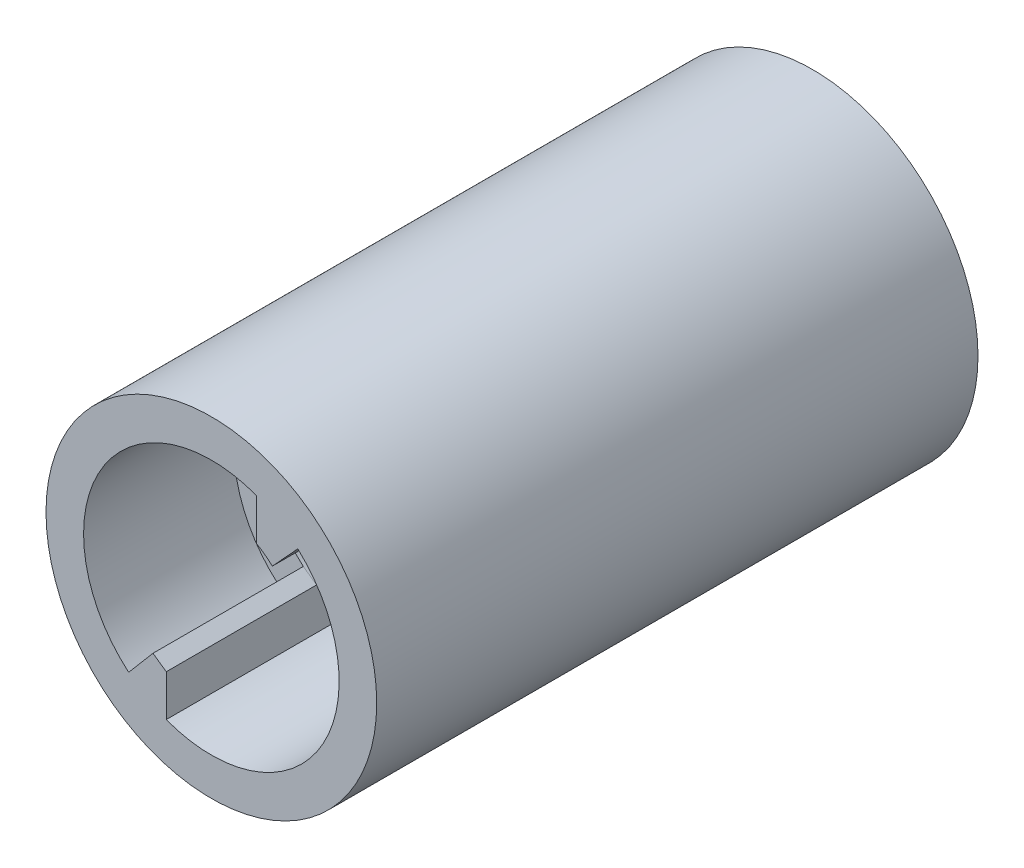
ISO-10303-21;
HEADER;
FILE_DESCRIPTION(('STEP AP214'),'2;1');
FILE_NAME('part.step','',(''),(''),'','','');
FILE_SCHEMA(('AUTOMOTIVE_DESIGN { 1 0 10303 214 1 1 1 1 }'));
ENDSEC;
DATA;
#1=APPLICATION_CONTEXT('core data for automotive mechanical design processes');
#2=APPLICATION_PROTOCOL_DEFINITION('international standard','automotive_design',2000,#1);
#3=PRODUCT_CONTEXT('',#1,'mechanical');
#4=PRODUCT('Part','Part','',(#3));
#5=PRODUCT_RELATED_PRODUCT_CATEGORY('part','',(#4));
#6=PRODUCT_DEFINITION_FORMATION('','',#4);
#7=PRODUCT_DEFINITION_CONTEXT('part definition',#1,'design');
#8=PRODUCT_DEFINITION('design','',#6,#7);
#9=PRODUCT_DEFINITION_SHAPE('','',#8);
#10=(LENGTH_UNIT() NAMED_UNIT(*) SI_UNIT(.MILLI.,.METRE.));
#11=(NAMED_UNIT(*) PLANE_ANGLE_UNIT() SI_UNIT($,.RADIAN.));
#12=(NAMED_UNIT(*) SI_UNIT($,.STERADIAN.) SOLID_ANGLE_UNIT());
#13=UNCERTAINTY_MEASURE_WITH_UNIT(LENGTH_MEASURE(1.E-05),#10,'distance_accuracy_value','');
#14=(GEOMETRIC_REPRESENTATION_CONTEXT(3) GLOBAL_UNCERTAINTY_ASSIGNED_CONTEXT((#13)) GLOBAL_UNIT_ASSIGNED_CONTEXT((#10,
#11,#12)) REPRESENTATION_CONTEXT('',''));
#15=CARTESIAN_POINT('',(0.,0.,0.));
#16=DIRECTION('',(0.,0.,1.));
#17=DIRECTION('',(1.,0.,0.));
#18=AXIS2_PLACEMENT_3D('',#15,#16,#17);
#19=CARTESIAN_POINT('',(3.,11.,0.));
#20=DIRECTION('',(1.,0.,0.));
#21=DIRECTION('',(0.,1.,0.));
#22=AXIS2_PLACEMENT_3D('',#19,#20,#21);
#23=PLANE('',#22);
#24=DIRECTION('',(0.,0.,-1.));
#25=VECTOR('',#24,1.);
#26=CARTESIAN_POINT('',(3.,7.95298686029343,25.));
#27=LINE('',#26,#25);
#28=CARTESIAN_POINT('',(3.,7.95298686029343,35.));
#29=VERTEX_POINT('',#28);
#30=CARTESIAN_POINT('',(3.,7.95298686029343,-5.));
#31=VERTEX_POINT('',#30);
#32=EDGE_CURVE('E55',#29,#31,#27,.T.);
#33=ORIENTED_EDGE('',*,*,#32,.T.);
#34=DIRECTION('',(0.,-1.,0.));
#35=VECTOR('',#34,1.);
#36=CARTESIAN_POINT('',(3.,0.,-5.));
#37=LINE('',#36,#35);
#38=CARTESIAN_POINT('',(3.,5.19615242270663,-5.));
#39=VERTEX_POINT('',#38);
#40=EDGE_CURVE('E11',#31,#39,#37,.T.);
#41=ORIENTED_EDGE('',*,*,#40,.T.);
#42=DIRECTION('',(0.,0.,-1.));
#43=VECTOR('',#42,1.);
#44=CARTESIAN_POINT('',(3.,5.19615242270663,25.));
#45=LINE('',#44,#43);
#46=CARTESIAN_POINT('',(3.,5.19615242270663,35.));
#47=VERTEX_POINT('',#46);
#48=EDGE_CURVE('E229',#39,#47,#45,.F.);
#49=ORIENTED_EDGE('',*,*,#48,.T.);
#50=DIRECTION('',(0.,-1.,0.));
#51=VECTOR('',#50,1.);
#52=CARTESIAN_POINT('',(3.,5.19615242270663,35.));
#53=LINE('',#52,#51);
#54=EDGE_CURVE('E213',#29,#47,#53,.T.);
#55=ORIENTED_EDGE('',*,*,#54,.F.);
#56=EDGE_LOOP('',(#33,#41,#49,#55));
#57=FACE_BOUND('',#56,.T.);
#58=ADVANCED_FACE('F41',(#57),#23,.F.);
#59=CARTESIAN_POINT('',(3.,-5.19615242270663,-5.));
#60=VERTEX_POINT('',#59);
#61=CARTESIAN_POINT('',(3.,-7.95298686029343,-5.));
#62=VERTEX_POINT('',#61);
#63=EDGE_CURVE('E45',#60,#62,#37,.T.);
#64=ORIENTED_EDGE('',*,*,#63,.T.);
#65=DIRECTION('',(0.,0.,-1.));
#66=VECTOR('',#65,1.);
#67=CARTESIAN_POINT('',(3.,-7.95298686029343,25.));
#68=LINE('',#67,#66);
#69=CARTESIAN_POINT('',(3.,-7.95298686029343,25.));
#70=VERTEX_POINT('',#69);
#71=EDGE_CURVE('E63',#62,#70,#68,.F.);
#72=ORIENTED_EDGE('',*,*,#71,.T.);
#73=DIRECTION('',(0.,1.,0.));
#74=VECTOR('',#73,1.);
#75=CARTESIAN_POINT('',(3.,11.,25.));
#76=LINE('',#75,#74);
#77=CARTESIAN_POINT('',(3.,-5.19615242270663,25.));
#78=VERTEX_POINT('',#77);
#79=EDGE_CURVE('E228',#70,#78,#76,.T.);
#80=ORIENTED_EDGE('',*,*,#79,.T.);
#81=DIRECTION('',(0.,0.,-1.));
#82=VECTOR('',#81,1.);
#83=CARTESIAN_POINT('',(3.,-5.19615242270663,25.));
#84=LINE('',#83,#82);
#85=EDGE_CURVE('E226',#78,#60,#84,.T.);
#86=ORIENTED_EDGE('',*,*,#85,.T.);
#87=EDGE_LOOP('',(#64,#72,#80,#86));
#88=FACE_BOUND('',#87,.T.);
#89=ADVANCED_FACE('F270',(#88),#23,.F.);
#90=CARTESIAN_POINT('',(-3.,11.,0.));
#91=DIRECTION('',(-1.,0.,0.));
#92=DIRECTION('',(0.,-1.,0.));
#93=AXIS2_PLACEMENT_3D('',#90,#91,#92);
#94=PLANE('',#93);
#95=DIRECTION('',(0.,0.,-1.));
#96=VECTOR('',#95,1.);
#97=CARTESIAN_POINT('',(-3.,-7.95298686029343,25.));
#98=LINE('',#97,#96);
#99=CARTESIAN_POINT('',(-3.,-7.95298686029343,-5.));
#100=VERTEX_POINT('',#99);
#101=CARTESIAN_POINT('',(-3.,-7.95298686029343,35.));
#102=VERTEX_POINT('',#101);
#103=EDGE_CURVE('E139',#100,#102,#98,.F.);
#104=ORIENTED_EDGE('',*,*,#103,.F.);
#105=DIRECTION('',(0.,1.,0.));
#106=VECTOR('',#105,1.);
#107=CARTESIAN_POINT('',(-3.,0.,-5.));
#108=LINE('',#107,#106);
#109=CARTESIAN_POINT('',(-3.,-5.19615242270663,-5.));
#110=VERTEX_POINT('',#109);
#111=EDGE_CURVE('E133',#100,#110,#108,.T.);
#112=ORIENTED_EDGE('',*,*,#111,.T.);
#113=DIRECTION('',(0.,0.,-1.));
#114=VECTOR('',#113,1.);
#115=CARTESIAN_POINT('',(-3.,-5.19615242270663,25.));
#116=LINE('',#115,#114);
#117=CARTESIAN_POINT('',(-3.,-5.19615242270663,25.));
#118=VERTEX_POINT('',#117);
#119=EDGE_CURVE('E137',#110,#118,#116,.F.);
#120=ORIENTED_EDGE('',*,*,#119,.T.);
#121=DIRECTION('',(0.,0.,-1.));
#122=VECTOR('',#121,1.);
#123=CARTESIAN_POINT('',(-3.,-5.19615242270663,35.));
#124=LINE('',#123,#122);
#125=CARTESIAN_POINT('',(-3.,-5.19615242270663,35.));
#126=VERTEX_POINT('',#125);
#127=EDGE_CURVE('E200',#126,#118,#124,.T.);
#128=ORIENTED_EDGE('',*,*,#127,.F.);
#129=DIRECTION('',(0.,1.,0.));
#130=VECTOR('',#129,1.);
#131=CARTESIAN_POINT('',(-3.,-10.5830052442584,35.));
#132=LINE('',#131,#130);
#133=EDGE_CURVE('E185',#102,#126,#132,.T.);
#134=ORIENTED_EDGE('',*,*,#133,.F.);
#135=EDGE_LOOP('',(#104,#112,#120,#128,#134));
#136=FACE_BOUND('',#135,.T.);
#137=ADVANCED_FACE('F135',(#136),#94,.F.);
#138=CARTESIAN_POINT('',(-3.,5.19615242270663,-5.));
#139=VERTEX_POINT('',#138);
#140=CARTESIAN_POINT('',(-3.,7.95298686029343,-5.));
#141=VERTEX_POINT('',#140);
#142=EDGE_CURVE('E143',#139,#141,#108,.T.);
#143=ORIENTED_EDGE('',*,*,#142,.T.);
#144=DIRECTION('',(0.,0.,-1.));
#145=VECTOR('',#144,1.);
#146=CARTESIAN_POINT('',(-3.,7.95298686029343,25.));
#147=LINE('',#146,#145);
#148=CARTESIAN_POINT('',(-3.,7.95298686029343,25.));
#149=VERTEX_POINT('',#148);
#150=EDGE_CURVE('E236',#149,#141,#147,.T.);
#151=ORIENTED_EDGE('',*,*,#150,.F.);
#152=DIRECTION('',(0.,-1.,0.));
#153=VECTOR('',#152,1.);
#154=CARTESIAN_POINT('',(-3.,11.,25.));
#155=LINE('',#154,#153);
#156=CARTESIAN_POINT('',(-3.,5.19615242270663,25.));
#157=VERTEX_POINT('',#156);
#158=EDGE_CURVE('E220',#149,#157,#155,.T.);
#159=ORIENTED_EDGE('',*,*,#158,.T.);
#160=DIRECTION('',(0.,0.,-1.));
#161=VECTOR('',#160,1.);
#162=CARTESIAN_POINT('',(-3.,5.19615242270663,25.));
#163=LINE('',#162,#161);
#164=EDGE_CURVE('E152',#157,#139,#163,.T.);
#165=ORIENTED_EDGE('',*,*,#164,.T.);
#166=EDGE_LOOP('',(#143,#151,#159,#165));
#167=FACE_BOUND('',#166,.T.);
#168=ADVANCED_FACE('F240',(#167),#94,.F.);
#169=CARTESIAN_POINT('',(0.,0.,25.));
#170=DIRECTION('',(0.,0.,-1.));
#171=DIRECTION('',(-1.,0.,0.));
#172=AXIS2_PLACEMENT_3D('',#169,#170,#171);
#173=CYLINDRICAL_SURFACE('',#172,6.);
#174=CARTESIAN_POINT('',(0.,0.,-5.));
#175=DIRECTION('',(0.,0.,-1.));
#176=DIRECTION('',(-1.,0.,0.));
#177=AXIS2_PLACEMENT_3D('',#174,#175,#176);
#178=CIRCLE('',#177,6.);
#179=EDGE_CURVE('E160',#39,#60,#178,.T.);
#180=ORIENTED_EDGE('',*,*,#179,.T.);
#181=ORIENTED_EDGE('',*,*,#85,.F.);
#182=CARTESIAN_POINT('',(0.,0.,25.));
#183=DIRECTION('',(0.,0.,1.));
#184=DIRECTION('',(1.,0.,0.));
#185=AXIS2_PLACEMENT_3D('',#182,#183,#184);
#186=CIRCLE('',#185,6.);
#187=CARTESIAN_POINT('',(4.05923501808678,4.41843989072365,25.));
#188=VERTEX_POINT('',#187);
#189=EDGE_CURVE('E225',#78,#188,#186,.T.);
#190=ORIENTED_EDGE('',*,*,#189,.T.);
#191=DIRECTION('',(0.,0.,-1.));
#192=VECTOR('',#191,1.);
#193=CARTESIAN_POINT('',(4.05923501808678,4.41843989072365,35.));
#194=LINE('',#193,#192);
#195=CARTESIAN_POINT('',(4.05923501808678,4.41843989072365,35.));
#196=VERTEX_POINT('',#195);
#197=EDGE_CURVE('E215',#196,#188,#194,.T.);
#198=ORIENTED_EDGE('',*,*,#197,.F.);
#199=CARTESIAN_POINT('',(-2.46608289344863E-11,-3.3586848580125E-11,35.));
#200=DIRECTION('',(0.,0.,-1.));
#201=DIRECTION('',(-1.,0.,0.));
#202=AXIS2_PLACEMENT_3D('',#199,#200,#201);
#203=CIRCLE('',#202,6.00000000004142);
#204=EDGE_CURVE('E204',#47,#196,#203,.T.);
#205=ORIENTED_EDGE('',*,*,#204,.F.);
#206=ORIENTED_EDGE('',*,*,#48,.F.);
#207=EDGE_LOOP('',(#180,#181,#190,#198,#205,#206));
#208=FACE_BOUND('',#207,.T.);
#209=ADVANCED_FACE('F283',(#208),#173,.F.);
#210=CARTESIAN_POINT('',(0.,0.,25.));
#211=DIRECTION('',(0.,0.,1.));
#212=DIRECTION('',(1.,0.,0.));
#213=AXIS2_PLACEMENT_3D('',#210,#211,#212);
#214=PLANE('',#213);
#215=CARTESIAN_POINT('',(0.,0.,25.));
#216=DIRECTION('',(0.,0.,1.));
#217=DIRECTION('',(1.,0.,0.));
#218=AXIS2_PLACEMENT_3D('',#215,#216,#217);
#219=CIRCLE('',#218,8.5);
#220=CARTESIAN_POINT('',(5.7505829422896,6.25945651185851,25.));
#221=VERTEX_POINT('',#220);
#222=EDGE_CURVE('E171',#70,#221,#219,.T.);
#223=ORIENTED_EDGE('',*,*,#222,.T.);
#224=DIRECTION('',(0.67653916968113,0.736406648453942,0.));
#225=VECTOR('',#224,1.);
#226=CARTESIAN_POINT('',(4.05923501808678,4.41843989072365,25.));
#227=LINE('',#226,#225);
#228=EDGE_CURVE('E203',#188,#221,#227,.T.);
#229=ORIENTED_EDGE('',*,*,#228,.F.);
#230=ORIENTED_EDGE('',*,*,#189,.F.);
#231=ORIENTED_EDGE('',*,*,#79,.F.);
#232=EDGE_LOOP('',(#223,#229,#230,#231));
#233=FACE_BOUND('',#232,.T.);
#234=ADVANCED_FACE('F43',(#233),#214,.T.);
#235=CARTESIAN_POINT('',(-5.50135305893383,-6.47959215699255,25.));
#236=VERTEX_POINT('',#235);
#237=EDGE_CURVE('E175',#149,#236,#219,.T.);
#238=ORIENTED_EDGE('',*,*,#237,.T.);
#239=DIRECTION('',(-0.647218006933392,-0.762304959646182,0.));
#240=VECTOR('',#239,1.);
#241=CARTESIAN_POINT('',(-7.11939807626731,-8.38535455610801,25.));
#242=LINE('',#241,#240);
#243=CARTESIAN_POINT('',(-3.88330804160035,-4.5738297578771,25.));
#244=VERTEX_POINT('',#243);
#245=EDGE_CURVE('E188',#244,#236,#242,.T.);
#246=ORIENTED_EDGE('',*,*,#245,.F.);
#247=CARTESIAN_POINT('',(0.,0.,25.));
#248=DIRECTION('',(0.,0.,1.));
#249=DIRECTION('',(1.,0.,0.));
#250=AXIS2_PLACEMENT_3D('',#247,#248,#249);
#251=CIRCLE('',#250,6.);
#252=EDGE_CURVE('E153',#157,#244,#251,.T.);
#253=ORIENTED_EDGE('',*,*,#252,.F.);
#254=ORIENTED_EDGE('',*,*,#158,.F.);
#255=EDGE_LOOP('',(#238,#246,#253,#254));
#256=FACE_BOUND('',#255,.T.);
#257=ADVANCED_FACE('F249',(#256),#214,.T.);
#258=CARTESIAN_POINT('',(0.,0.,25.));
#259=DIRECTION('',(0.,0.,-1.));
#260=DIRECTION('',(-1.,0.,0.));
#261=AXIS2_PLACEMENT_3D('',#258,#259,#260);
#262=CYLINDRICAL_SURFACE('',#261,8.5);
#263=ORIENTED_EDGE('',*,*,#71,.F.);
#264=CARTESIAN_POINT('',(0.,0.,-5.));
#265=DIRECTION('',(0.,0.,-1.));
#266=DIRECTION('',(-1.,0.,0.));
#267=AXIS2_PLACEMENT_3D('',#264,#265,#266);
#268=CIRCLE('',#267,8.5);
#269=EDGE_CURVE('E166',#62,#100,#268,.T.);
#270=ORIENTED_EDGE('',*,*,#269,.T.);
#271=ORIENTED_EDGE('',*,*,#103,.T.);
#272=CARTESIAN_POINT('',(0.,0.,35.));
#273=DIRECTION('',(0.,0.,1.));
#274=DIRECTION('',(1.,0.,0.));
#275=AXIS2_PLACEMENT_3D('',#272,#273,#274);
#276=CIRCLE('',#275,8.5);
#277=CARTESIAN_POINT('',(5.7505829422896,6.25945651185851,35.));
#278=VERTEX_POINT('',#277);
#279=EDGE_CURVE('E172',#102,#278,#276,.T.);
#280=ORIENTED_EDGE('',*,*,#279,.T.);
#281=DIRECTION('',(0.,0.,-1.));
#282=VECTOR('',#281,1.);
#283=CARTESIAN_POINT('',(5.7505829422896,6.25945651185851,35.));
#284=LINE('',#283,#282);
#285=EDGE_CURVE('E181',#221,#278,#284,.F.);
#286=ORIENTED_EDGE('',*,*,#285,.F.);
#287=ORIENTED_EDGE('',*,*,#222,.F.);
#288=EDGE_LOOP('',(#263,#270,#271,#280,#286,#287));
#289=FACE_BOUND('',#288,.T.);
#290=ADVANCED_FACE('F278',(#289),#262,.F.);
#291=ORIENTED_EDGE('',*,*,#32,.F.);
#292=CARTESIAN_POINT('',(-5.50135305893383,-6.47959215699255,35.));
#293=VERTEX_POINT('',#292);
#294=EDGE_CURVE('E174',#29,#293,#276,.T.);
#295=ORIENTED_EDGE('',*,*,#294,.T.);
#296=DIRECTION('',(0.,0.,-1.));
#297=VECTOR('',#296,1.);
#298=CARTESIAN_POINT('',(-5.50135305893383,-6.47959215699255,35.));
#299=LINE('',#298,#297);
#300=EDGE_CURVE('E178',#236,#293,#299,.F.);
#301=ORIENTED_EDGE('',*,*,#300,.F.);
#302=ORIENTED_EDGE('',*,*,#237,.F.);
#303=ORIENTED_EDGE('',*,*,#150,.T.);
#304=EDGE_CURVE('E161',#141,#31,#268,.T.);
#305=ORIENTED_EDGE('',*,*,#304,.T.);
#306=EDGE_LOOP('',(#291,#295,#301,#302,#303,#305));
#307=FACE_BOUND('',#306,.T.);
#308=ADVANCED_FACE('F244',(#307),#262,.F.);
#309=CARTESIAN_POINT('',(0.,0.,25.));
#310=DIRECTION('',(0.,0.,-1.));
#311=DIRECTION('',(-1.,0.,0.));
#312=AXIS2_PLACEMENT_3D('',#309,#310,#311);
#313=CYLINDRICAL_SURFACE('',#312,11.);
#314=CARTESIAN_POINT('',(0.,0.,-5.));
#315=DIRECTION('',(0.,0.,-1.));
#316=DIRECTION('',(-1.,0.,0.));
#317=AXIS2_PLACEMENT_3D('',#314,#315,#316);
#318=CIRCLE('',#317,11.);
#319=CARTESIAN_POINT('',(-11.,0.,-5.));
#320=VERTEX_POINT('',#319);
#321=EDGE_CURVE('E164',#320,#320,#318,.T.);
#322=ORIENTED_EDGE('',*,*,#321,.F.);
#323=EDGE_LOOP('',(#322));
#324=FACE_BOUND('',#323,.T.);
#325=CARTESIAN_POINT('',(-5.94475857429444E-10,-1.06367692431775E-09,35.));
#326=DIRECTION('',(0.,0.,1.));
#327=DIRECTION('',(-1.,0.,0.));
#328=AXIS2_PLACEMENT_3D('',#325,#326,#327);
#329=CIRCLE('',#328,11.0000000011855);
#330=CARTESIAN_POINT('',(-11.00000000178,-1.06367692431775E-09,35.));
#331=VERTEX_POINT('',#330);
#332=EDGE_CURVE('E210',#331,#331,#329,.T.);
#333=ORIENTED_EDGE('',*,*,#332,.F.);
#334=EDGE_LOOP('',(#333));
#335=FACE_BOUND('',#334,.T.);
#336=ADVANCED_FACE('F282',(#324,#335),#313,.T.);
#337=EDGE_CURVE('E149',#110,#139,#178,.T.);
#338=ORIENTED_EDGE('',*,*,#337,.T.);
#339=ORIENTED_EDGE('',*,*,#164,.F.);
#340=ORIENTED_EDGE('',*,*,#252,.T.);
#341=CARTESIAN_POINT('',(0.,0.,25.));
#342=DIRECTION('',(0.,0.,-1.));
#343=DIRECTION('',(-1.,0.,0.));
#344=AXIS2_PLACEMENT_3D('',#341,#342,#343);
#345=CIRCLE('',#344,6.);
#346=EDGE_CURVE('E151',#118,#244,#345,.T.);
#347=ORIENTED_EDGE('',*,*,#346,.F.);
#348=ORIENTED_EDGE('',*,*,#119,.F.);
#349=EDGE_LOOP('',(#338,#339,#340,#347,#348));
#350=FACE_BOUND('',#349,.T.);
#351=ADVANCED_FACE('F147',(#350),#173,.F.);
#352=CARTESIAN_POINT('',(4.05923501808678,4.41843989072365,35.));
#353=DIRECTION('',(-0.736406648453942,0.67653916968113,0.));
#354=DIRECTION('',(-0.67653916968113,-0.736406648453942,0.));
#355=AXIS2_PLACEMENT_3D('',#352,#353,#354);
#356=PLANE('',#355);
#357=ORIENTED_EDGE('',*,*,#228,.T.);
#358=ORIENTED_EDGE('',*,*,#285,.T.);
#359=DIRECTION('',(0.67653916968113,0.736406648453942,0.));
#360=VECTOR('',#359,1.);
#361=CARTESIAN_POINT('',(4.05923501808678,4.41843989072365,35.));
#362=LINE('',#361,#360);
#363=EDGE_CURVE('E207',#196,#278,#362,.T.);
#364=ORIENTED_EDGE('',*,*,#363,.F.);
#365=ORIENTED_EDGE('',*,*,#197,.T.);
#366=EDGE_LOOP('',(#357,#358,#364,#365));
#367=FACE_BOUND('',#366,.T.);
#368=ADVANCED_FACE('F281',(#367),#356,.F.);
#369=CARTESIAN_POINT('',(-2.46608289344863E-11,-3.3586848580125E-11,35.));
#370=DIRECTION('',(0.,0.,-1.));
#371=DIRECTION('',(-1.,0.,0.));
#372=AXIS2_PLACEMENT_3D('',#369,#370,#371);
#373=PLANE('',#372);
#374=ORIENTED_EDGE('',*,*,#294,.F.);
#375=ORIENTED_EDGE('',*,*,#54,.T.);
#376=ORIENTED_EDGE('',*,*,#204,.T.);
#377=ORIENTED_EDGE('',*,*,#363,.T.);
#378=ORIENTED_EDGE('',*,*,#279,.F.);
#379=ORIENTED_EDGE('',*,*,#133,.T.);
#380=DIRECTION('',(-0.817485919456039,0.575948584069025,0.));
#381=VECTOR('',#380,1.);
#382=CARTESIAN_POINT('',(-3.,-5.19615242270663,35.));
#383=LINE('',#382,#381);
#384=CARTESIAN_POINT('',(-3.88330804160035,-4.5738297578771,35.));
#385=VERTEX_POINT('',#384);
#386=EDGE_CURVE('E187',#126,#385,#383,.T.);
#387=ORIENTED_EDGE('',*,*,#386,.T.);
#388=DIRECTION('',(-0.647218006933392,-0.762304959646182,0.));
#389=VECTOR('',#388,1.);
#390=CARTESIAN_POINT('',(-7.11939807626731,-8.38535455610801,35.));
#391=LINE('',#390,#389);
#392=EDGE_CURVE('E190',#385,#293,#391,.T.);
#393=ORIENTED_EDGE('',*,*,#392,.T.);
#394=EDGE_LOOP('',(#374,#375,#376,#377,#378,#379,#387,#393));
#395=FACE_BOUND('',#394,.T.);
#396=ORIENTED_EDGE('',*,*,#332,.T.);
#397=EDGE_LOOP('',(#396));
#398=FACE_BOUND('',#397,.T.);
#399=ADVANCED_FACE('F293',(#395,#398),#373,.F.);
#400=CARTESIAN_POINT('',(-3.,-5.19615242270663,35.));
#401=DIRECTION('',(-0.575948584069025,-0.817485919456038,0.));
#402=DIRECTION('',(0.817485919456039,-0.575948584069026,0.));
#403=AXIS2_PLACEMENT_3D('',#400,#401,#402);
#404=PLANE('',#403);
#405=DIRECTION('',(-0.817485919456039,0.575948584069025,0.));
#406=VECTOR('',#405,1.);
#407=CARTESIAN_POINT('',(-3.,-5.19615242270663,25.));
#408=LINE('',#407,#406);
#409=EDGE_CURVE('E184',#118,#244,#408,.T.);
#410=ORIENTED_EDGE('',*,*,#409,.T.);
#411=DIRECTION('',(0.,0.,-1.));
#412=VECTOR('',#411,1.);
#413=CARTESIAN_POINT('',(-3.88330804160035,-4.5738297578771,35.));
#414=LINE('',#413,#412);
#415=EDGE_CURVE('E193',#385,#244,#414,.T.);
#416=ORIENTED_EDGE('',*,*,#415,.F.);
#417=ORIENTED_EDGE('',*,*,#386,.F.);
#418=ORIENTED_EDGE('',*,*,#127,.T.);
#419=EDGE_LOOP('',(#410,#416,#417,#418));
#420=FACE_BOUND('',#419,.T.);
#421=ADVANCED_FACE('F257',(#420),#404,.F.);
#422=CARTESIAN_POINT('',(-7.11939807626731,-8.38535455610801,35.));
#423=DIRECTION('',(0.762304959646182,-0.647218006933392,0.));
#424=DIRECTION('',(0.647218006933392,0.762304959646182,0.));
#425=AXIS2_PLACEMENT_3D('',#422,#423,#424);
#426=PLANE('',#425);
#427=ORIENTED_EDGE('',*,*,#245,.T.);
#428=ORIENTED_EDGE('',*,*,#300,.T.);
#429=ORIENTED_EDGE('',*,*,#392,.F.);
#430=ORIENTED_EDGE('',*,*,#415,.T.);
#431=EDGE_LOOP('',(#427,#428,#429,#430));
#432=FACE_BOUND('',#431,.T.);
#433=ADVANCED_FACE('F252',(#432),#426,.F.);
#434=CARTESIAN_POINT('',(0.,0.,25.));
#435=DIRECTION('',(0.,0.,-1.));
#436=DIRECTION('',(-1.,0.,0.));
#437=AXIS2_PLACEMENT_3D('',#434,#435,#436);
#438=PLANE('',#437);
#439=ORIENTED_EDGE('',*,*,#409,.F.);
#440=ORIENTED_EDGE('',*,*,#346,.T.);
#441=EDGE_LOOP('',(#439,#440));
#442=FACE_BOUND('',#441,.T.);
#443=ADVANCED_FACE('F260',(#442),#438,.T.);
#444=CARTESIAN_POINT('',(0.,0.,-5.));
#445=DIRECTION('',(0.,0.,-1.));
#446=DIRECTION('',(-1.,0.,0.));
#447=AXIS2_PLACEMENT_3D('',#444,#445,#446);
#448=PLANE('',#447);
#449=ORIENTED_EDGE('',*,*,#269,.F.);
#450=ORIENTED_EDGE('',*,*,#63,.F.);
#451=ORIENTED_EDGE('',*,*,#179,.F.);
#452=ORIENTED_EDGE('',*,*,#40,.F.);
#453=ORIENTED_EDGE('',*,*,#304,.F.);
#454=ORIENTED_EDGE('',*,*,#142,.F.);
#455=ORIENTED_EDGE('',*,*,#337,.F.);
#456=ORIENTED_EDGE('',*,*,#111,.F.);
#457=EDGE_LOOP('',(#449,#450,#451,#452,#453,#454,#455,#456));
#458=FACE_BOUND('',#457,.T.);
#459=ORIENTED_EDGE('',*,*,#321,.T.);
#460=EDGE_LOOP('',(#459));
#461=FACE_BOUND('',#460,.T.);
#462=ADVANCED_FACE('F156',(#458,#461),#448,.T.);
#463=CLOSED_SHELL('',(#58,#89,#137,#168,#209,#234,#257,#290,#308,#336,#351,#368,#399,#421,#433,
#443,#462));
#464=MANIFOLD_SOLID_BREP('B2',#463);
#465=ADVANCED_BREP_SHAPE_REPRESENTATION('',(#18,#464),#14);
#466=SHAPE_DEFINITION_REPRESENTATION(#9,#465);
ENDSEC;
END-ISO-10303-21;
